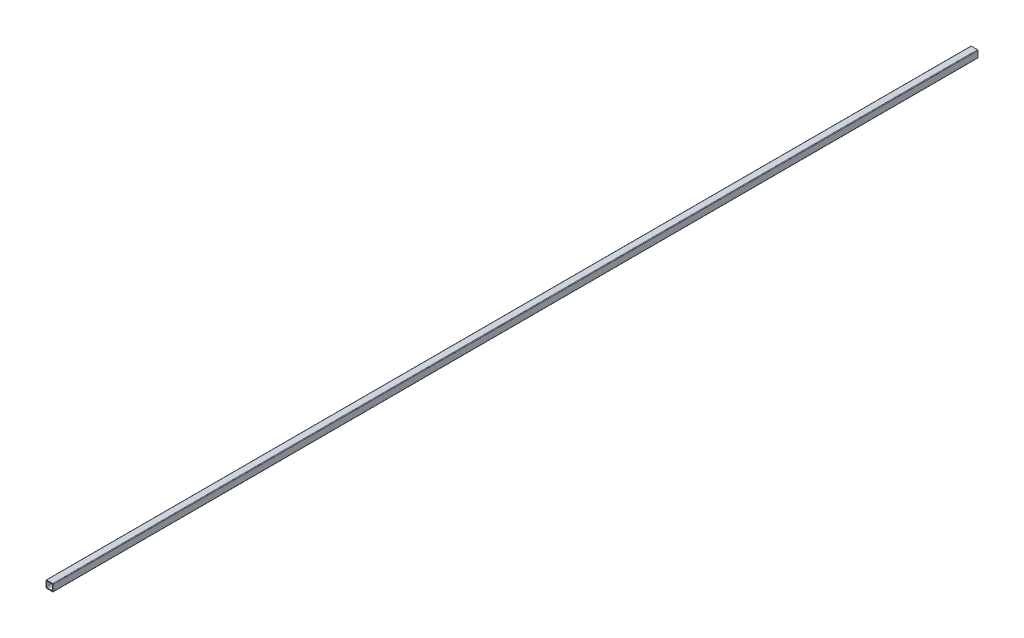
ISO-10303-21;
HEADER;
FILE_DESCRIPTION(('STEP AP214'),'2;1');
FILE_NAME('part.step','',(''),(''),'','','');
FILE_SCHEMA(('AUTOMOTIVE_DESIGN { 1 0 10303 214 1 1 1 1 }'));
ENDSEC;
DATA;
#1=APPLICATION_CONTEXT('core data for automotive mechanical design processes');
#2=APPLICATION_PROTOCOL_DEFINITION('international standard','automotive_design',2000,#1);
#3=PRODUCT_CONTEXT('',#1,'mechanical');
#4=PRODUCT('Part','Part','',(#3));
#5=PRODUCT_RELATED_PRODUCT_CATEGORY('part','',(#4));
#6=PRODUCT_DEFINITION_FORMATION('','',#4);
#7=PRODUCT_DEFINITION_CONTEXT('part definition',#1,'design');
#8=PRODUCT_DEFINITION('design','',#6,#7);
#9=PRODUCT_DEFINITION_SHAPE('','',#8);
#10=(LENGTH_UNIT() NAMED_UNIT(*) SI_UNIT(.MILLI.,.METRE.));
#11=(NAMED_UNIT(*) PLANE_ANGLE_UNIT() SI_UNIT($,.RADIAN.));
#12=(NAMED_UNIT(*) SI_UNIT($,.STERADIAN.) SOLID_ANGLE_UNIT());
#13=UNCERTAINTY_MEASURE_WITH_UNIT(LENGTH_MEASURE(1.E-05),#10,'distance_accuracy_value','');
#14=(GEOMETRIC_REPRESENTATION_CONTEXT(3) GLOBAL_UNCERTAINTY_ASSIGNED_CONTEXT((#13)) GLOBAL_UNIT_ASSIGNED_CONTEXT((#10,
#11,#12)) REPRESENTATION_CONTEXT('',''));
#15=CARTESIAN_POINT('',(0.,0.,0.));
#16=DIRECTION('',(0.,0.,1.));
#17=DIRECTION('',(1.,0.,0.));
#18=AXIS2_PLACEMENT_3D('',#15,#16,#17);
#19=CARTESIAN_POINT('',(17.526,17.526,-2438.4));
#20=DIRECTION('',(0.,0.,1.));
#21=DIRECTION('',(1.,0.,0.));
#22=AXIS2_PLACEMENT_3D('',#19,#20,#21);
#23=CYLINDRICAL_SURFACE('',#22,1.524);
#24=CARTESIAN_POINT('',(17.526,17.526,0.));
#25=DIRECTION('',(0.,0.,1.));
#26=DIRECTION('',(1.,0.,0.));
#27=AXIS2_PLACEMENT_3D('',#24,#25,#26);
#28=CIRCLE('',#27,1.524);
#29=CARTESIAN_POINT('',(19.05,17.526,0.));
#30=VERTEX_POINT('',#29);
#31=CARTESIAN_POINT('',(17.526,19.05,0.));
#32=VERTEX_POINT('',#31);
#33=EDGE_CURVE('E234',#30,#32,#28,.T.);
#34=ORIENTED_EDGE('',*,*,#33,.F.);
#35=DIRECTION('',(0.,0.,1.));
#36=VECTOR('',#35,1.);
#37=CARTESIAN_POINT('',(19.05,17.526,-2438.4));
#38=LINE('',#37,#36);
#39=CARTESIAN_POINT('',(19.05,17.526,-2438.4));
#40=VERTEX_POINT('',#39);
#41=EDGE_CURVE('E11',#40,#30,#38,.T.);
#42=ORIENTED_EDGE('',*,*,#41,.F.);
#43=CARTESIAN_POINT('',(17.526,17.526,-2438.4));
#44=DIRECTION('',(0.,0.,1.));
#45=DIRECTION('',(1.,0.,0.));
#46=AXIS2_PLACEMENT_3D('',#43,#44,#45);
#47=CIRCLE('',#46,1.524);
#48=CARTESIAN_POINT('',(17.526,19.05,-2438.4));
#49=VERTEX_POINT('',#48);
#50=EDGE_CURVE('E252',#40,#49,#47,.T.);
#51=ORIENTED_EDGE('',*,*,#50,.T.);
#52=DIRECTION('',(0.,0.,1.));
#53=VECTOR('',#52,1.);
#54=CARTESIAN_POINT('',(17.526,19.05,-2438.4));
#55=LINE('',#54,#53);
#56=EDGE_CURVE('E48',#49,#32,#55,.T.);
#57=ORIENTED_EDGE('',*,*,#56,.T.);
#58=EDGE_LOOP('',(#34,#42,#51,#57));
#59=FACE_BOUND('',#58,.T.);
#60=ADVANCED_FACE('F45',(#59),#23,.T.);
#61=CARTESIAN_POINT('',(19.05,1.52400000000001,-2438.4));
#62=DIRECTION('',(1.,0.,0.));
#63=DIRECTION('',(0.,0.,-1.));
#64=AXIS2_PLACEMENT_3D('',#61,#62,#63);
#65=PLANE('',#64);
#66=DIRECTION('',(0.,1.,0.));
#67=VECTOR('',#66,1.);
#68=CARTESIAN_POINT('',(19.05,1.52400000000001,0.));
#69=LINE('',#68,#67);
#70=CARTESIAN_POINT('',(19.05,1.52400000000001,0.));
#71=VERTEX_POINT('',#70);
#72=EDGE_CURVE('E257',#71,#30,#69,.T.);
#73=ORIENTED_EDGE('',*,*,#72,.F.);
#74=DIRECTION('',(0.,0.,1.));
#75=VECTOR('',#74,1.);
#76=CARTESIAN_POINT('',(19.05,1.52400000000001,-2438.4));
#77=LINE('',#76,#75);
#78=CARTESIAN_POINT('',(19.05,1.52400000000001,-2438.4));
#79=VERTEX_POINT('',#78);
#80=EDGE_CURVE('E54',#79,#71,#77,.T.);
#81=ORIENTED_EDGE('',*,*,#80,.F.);
#82=DIRECTION('',(0.,1.,0.));
#83=VECTOR('',#82,1.);
#84=CARTESIAN_POINT('',(19.05,1.52400000000001,-2438.4));
#85=LINE('',#84,#83);
#86=EDGE_CURVE('E281',#79,#40,#85,.T.);
#87=ORIENTED_EDGE('',*,*,#86,.T.);
#88=ORIENTED_EDGE('',*,*,#41,.T.);
#89=EDGE_LOOP('',(#73,#81,#87,#88));
#90=FACE_BOUND('',#89,.T.);
#91=ADVANCED_FACE('F344',(#90),#65,.T.);
#92=CARTESIAN_POINT('',(17.526,1.524,-2438.4));
#93=DIRECTION('',(0.,0.,1.));
#94=DIRECTION('',(1.,0.,0.));
#95=AXIS2_PLACEMENT_3D('',#92,#93,#94);
#96=CYLINDRICAL_SURFACE('',#95,1.524);
#97=CARTESIAN_POINT('',(17.526,1.524,0.));
#98=DIRECTION('',(0.,0.,1.));
#99=DIRECTION('',(-1.,0.,0.));
#100=AXIS2_PLACEMENT_3D('',#97,#98,#99);
#101=CIRCLE('',#100,1.524);
#102=CARTESIAN_POINT('',(17.526,0.,0.));
#103=VERTEX_POINT('',#102);
#104=EDGE_CURVE('E308',#103,#71,#101,.T.);
#105=ORIENTED_EDGE('',*,*,#104,.F.);
#106=DIRECTION('',(0.,0.,1.));
#107=VECTOR('',#106,1.);
#108=CARTESIAN_POINT('',(17.526,0.,-2438.4));
#109=LINE('',#108,#107);
#110=CARTESIAN_POINT('',(17.526,0.,-2438.4));
#111=VERTEX_POINT('',#110);
#112=EDGE_CURVE('E317',#111,#103,#109,.T.);
#113=ORIENTED_EDGE('',*,*,#112,.F.);
#114=CARTESIAN_POINT('',(17.526,1.524,-2438.4));
#115=DIRECTION('',(0.,0.,1.));
#116=DIRECTION('',(-1.,0.,0.));
#117=AXIS2_PLACEMENT_3D('',#114,#115,#116);
#118=CIRCLE('',#117,1.524);
#119=EDGE_CURVE('E277',#111,#79,#118,.T.);
#120=ORIENTED_EDGE('',*,*,#119,.T.);
#121=ORIENTED_EDGE('',*,*,#80,.T.);
#122=EDGE_LOOP('',(#105,#113,#120,#121));
#123=FACE_BOUND('',#122,.T.);
#124=ADVANCED_FACE('F363',(#123),#96,.T.);
#125=CARTESIAN_POINT('',(1.52400000000001,0.,-2438.4));
#126=DIRECTION('',(0.,-1.,0.));
#127=DIRECTION('',(0.,0.,-1.));
#128=AXIS2_PLACEMENT_3D('',#125,#126,#127);
#129=PLANE('',#128);
#130=DIRECTION('',(1.,0.,0.));
#131=VECTOR('',#130,1.);
#132=CARTESIAN_POINT('',(1.52400000000001,0.,0.));
#133=LINE('',#132,#131);
#134=CARTESIAN_POINT('',(1.52400000000001,0.,0.));
#135=VERTEX_POINT('',#134);
#136=EDGE_CURVE('E304',#135,#103,#133,.T.);
#137=ORIENTED_EDGE('',*,*,#136,.F.);
#138=DIRECTION('',(0.,0.,1.));
#139=VECTOR('',#138,1.);
#140=CARTESIAN_POINT('',(1.52400000000001,0.,-2438.4));
#141=LINE('',#140,#139);
#142=CARTESIAN_POINT('',(1.52400000000001,0.,-2438.4));
#143=VERTEX_POINT('',#142);
#144=EDGE_CURVE('E320',#143,#135,#141,.T.);
#145=ORIENTED_EDGE('',*,*,#144,.F.);
#146=DIRECTION('',(1.,0.,0.));
#147=VECTOR('',#146,1.);
#148=CARTESIAN_POINT('',(1.52400000000001,0.,-2438.4));
#149=LINE('',#148,#147);
#150=EDGE_CURVE('E273',#143,#111,#149,.T.);
#151=ORIENTED_EDGE('',*,*,#150,.T.);
#152=ORIENTED_EDGE('',*,*,#112,.T.);
#153=EDGE_LOOP('',(#137,#145,#151,#152));
#154=FACE_BOUND('',#153,.T.);
#155=ADVANCED_FACE('F361',(#154),#129,.T.);
#156=CARTESIAN_POINT('',(1.524,1.524,-2438.4));
#157=DIRECTION('',(0.,0.,1.));
#158=DIRECTION('',(1.,0.,0.));
#159=AXIS2_PLACEMENT_3D('',#156,#157,#158);
#160=CYLINDRICAL_SURFACE('',#159,1.524);
#161=CARTESIAN_POINT('',(1.524,1.524,0.));
#162=DIRECTION('',(0.,0.,1.));
#163=DIRECTION('',(-1.,0.,0.));
#164=AXIS2_PLACEMENT_3D('',#161,#162,#163);
#165=CIRCLE('',#164,1.524);
#166=CARTESIAN_POINT('',(0.,1.524,0.));
#167=VERTEX_POINT('',#166);
#168=EDGE_CURVE('E300',#167,#135,#165,.T.);
#169=ORIENTED_EDGE('',*,*,#168,.F.);
#170=DIRECTION('',(0.,0.,1.));
#171=VECTOR('',#170,1.);
#172=CARTESIAN_POINT('',(0.,1.524,-2438.4));
#173=LINE('',#172,#171);
#174=CARTESIAN_POINT('',(0.,1.524,-2438.4));
#175=VERTEX_POINT('',#174);
#176=EDGE_CURVE('E323',#175,#167,#173,.T.);
#177=ORIENTED_EDGE('',*,*,#176,.F.);
#178=CARTESIAN_POINT('',(1.524,1.524,-2438.4));
#179=DIRECTION('',(0.,0.,1.));
#180=DIRECTION('',(-1.,0.,0.));
#181=AXIS2_PLACEMENT_3D('',#178,#179,#180);
#182=CIRCLE('',#181,1.524);
#183=EDGE_CURVE('E269',#175,#143,#182,.T.);
#184=ORIENTED_EDGE('',*,*,#183,.T.);
#185=ORIENTED_EDGE('',*,*,#144,.T.);
#186=EDGE_LOOP('',(#169,#177,#184,#185));
#187=FACE_BOUND('',#186,.T.);
#188=ADVANCED_FACE('F357',(#187),#160,.T.);
#189=CARTESIAN_POINT('',(0.,1.52400000000001,-2438.4));
#190=DIRECTION('',(-1.,0.,0.));
#191=DIRECTION('',(0.,0.,1.));
#192=AXIS2_PLACEMENT_3D('',#189,#190,#191);
#193=PLANE('',#192);
#194=DIRECTION('',(0.,-1.,0.));
#195=VECTOR('',#194,1.);
#196=CARTESIAN_POINT('',(0.,1.52400000000001,0.));
#197=LINE('',#196,#195);
#198=CARTESIAN_POINT('',(0.,17.526,0.));
#199=VERTEX_POINT('',#198);
#200=EDGE_CURVE('E296',#199,#167,#197,.T.);
#201=ORIENTED_EDGE('',*,*,#200,.F.);
#202=DIRECTION('',(0.,0.,1.));
#203=VECTOR('',#202,1.);
#204=CARTESIAN_POINT('',(0.,17.526,-2438.4));
#205=LINE('',#204,#203);
#206=CARTESIAN_POINT('',(0.,17.526,-2438.4));
#207=VERTEX_POINT('',#206);
#208=EDGE_CURVE('E326',#207,#199,#205,.T.);
#209=ORIENTED_EDGE('',*,*,#208,.F.);
#210=DIRECTION('',(0.,-1.,0.));
#211=VECTOR('',#210,1.);
#212=CARTESIAN_POINT('',(0.,1.52400000000001,-2438.4));
#213=LINE('',#212,#211);
#214=EDGE_CURVE('E265',#207,#175,#213,.T.);
#215=ORIENTED_EDGE('',*,*,#214,.T.);
#216=ORIENTED_EDGE('',*,*,#176,.T.);
#217=EDGE_LOOP('',(#201,#209,#215,#216));
#218=FACE_BOUND('',#217,.T.);
#219=ADVANCED_FACE('F355',(#218),#193,.T.);
#220=CARTESIAN_POINT('',(1.524,17.526,-2438.4));
#221=DIRECTION('',(0.,0.,1.));
#222=DIRECTION('',(1.,0.,0.));
#223=AXIS2_PLACEMENT_3D('',#220,#221,#222);
#224=CYLINDRICAL_SURFACE('',#223,1.524);
#225=CARTESIAN_POINT('',(1.524,17.526,0.));
#226=DIRECTION('',(0.,0.,1.));
#227=DIRECTION('',(-1.,0.,0.));
#228=AXIS2_PLACEMENT_3D('',#225,#226,#227);
#229=CIRCLE('',#228,1.524);
#230=CARTESIAN_POINT('',(1.52400000000001,19.05,0.));
#231=VERTEX_POINT('',#230);
#232=EDGE_CURVE('E292',#231,#199,#229,.T.);
#233=ORIENTED_EDGE('',*,*,#232,.F.);
#234=DIRECTION('',(0.,0.,1.));
#235=VECTOR('',#234,1.);
#236=CARTESIAN_POINT('',(1.52400000000001,19.05,-2438.4));
#237=LINE('',#236,#235);
#238=CARTESIAN_POINT('',(1.52400000000001,19.05,-2438.4));
#239=VERTEX_POINT('',#238);
#240=EDGE_CURVE('E328',#239,#231,#237,.T.);
#241=ORIENTED_EDGE('',*,*,#240,.F.);
#242=CARTESIAN_POINT('',(1.524,17.526,-2438.4));
#243=DIRECTION('',(0.,0.,1.));
#244=DIRECTION('',(-1.,0.,0.));
#245=AXIS2_PLACEMENT_3D('',#242,#243,#244);
#246=CIRCLE('',#245,1.524);
#247=EDGE_CURVE('E261',#239,#207,#246,.T.);
#248=ORIENTED_EDGE('',*,*,#247,.T.);
#249=ORIENTED_EDGE('',*,*,#208,.T.);
#250=EDGE_LOOP('',(#233,#241,#248,#249));
#251=FACE_BOUND('',#250,.T.);
#252=ADVANCED_FACE('F351',(#251),#224,.T.);
#253=CARTESIAN_POINT('',(1.52400000000001,19.05,-2438.4));
#254=DIRECTION('',(0.,1.,0.));
#255=DIRECTION('',(0.,0.,1.));
#256=AXIS2_PLACEMENT_3D('',#253,#254,#255);
#257=PLANE('',#256);
#258=DIRECTION('',(-1.,0.,0.));
#259=VECTOR('',#258,1.);
#260=CARTESIAN_POINT('',(1.52400000000001,19.05,0.));
#261=LINE('',#260,#259);
#262=EDGE_CURVE('E288',#32,#231,#261,.T.);
#263=ORIENTED_EDGE('',*,*,#262,.F.);
#264=ORIENTED_EDGE('',*,*,#56,.F.);
#265=DIRECTION('',(-1.,0.,0.));
#266=VECTOR('',#265,1.);
#267=CARTESIAN_POINT('',(1.52400000000001,19.05,-2438.4));
#268=LINE('',#267,#266);
#269=EDGE_CURVE('E256',#49,#239,#268,.T.);
#270=ORIENTED_EDGE('',*,*,#269,.T.);
#271=ORIENTED_EDGE('',*,*,#240,.T.);
#272=EDGE_LOOP('',(#263,#264,#270,#271));
#273=FACE_BOUND('',#272,.T.);
#274=ADVANCED_FACE('F338',(#273),#257,.T.);
#275=CARTESIAN_POINT('',(17.526,17.526,-2438.4));
#276=DIRECTION('',(0.,0.,1.));
#277=DIRECTION('',(1.,0.,0.));
#278=AXIS2_PLACEMENT_3D('',#275,#276,#277);
#279=PLANE('',#278);
#280=DIRECTION('',(0.,1.,0.));
#281=VECTOR('',#280,1.);
#282=CARTESIAN_POINT('',(17.145,13.97,-2438.4));
#283=LINE('',#282,#281);
#284=CARTESIAN_POINT('',(17.145,5.08000000000002,-2438.4));
#285=VERTEX_POINT('',#284);
#286=CARTESIAN_POINT('',(17.145,13.97,-2438.4));
#287=VERTEX_POINT('',#286);
#288=EDGE_CURVE('E168',#285,#287,#283,.T.);
#289=ORIENTED_EDGE('',*,*,#288,.T.);
#290=CARTESIAN_POINT('',(13.97,13.97,-2438.4));
#291=DIRECTION('',(0.,0.,1.));
#292=DIRECTION('',(-1.,0.,0.));
#293=AXIS2_PLACEMENT_3D('',#290,#291,#292);
#294=CIRCLE('',#293,3.175);
#295=CARTESIAN_POINT('',(13.97,17.145,-2438.4));
#296=VERTEX_POINT('',#295);
#297=EDGE_CURVE('E161',#287,#296,#294,.T.);
#298=ORIENTED_EDGE('',*,*,#297,.T.);
#299=DIRECTION('',(-1.,0.,0.));
#300=VECTOR('',#299,1.);
#301=CARTESIAN_POINT('',(5.08000000000003,17.145,-2438.4));
#302=LINE('',#301,#300);
#303=CARTESIAN_POINT('',(5.08000000000003,17.145,-2438.4));
#304=VERTEX_POINT('',#303);
#305=EDGE_CURVE('E171',#296,#304,#302,.T.);
#306=ORIENTED_EDGE('',*,*,#305,.T.);
#307=CARTESIAN_POINT('',(5.08000000000001,13.97,-2438.4));
#308=DIRECTION('',(0.,0.,1.));
#309=DIRECTION('',(-1.,0.,0.));
#310=AXIS2_PLACEMENT_3D('',#307,#308,#309);
#311=CIRCLE('',#310,3.175);
#312=CARTESIAN_POINT('',(1.90500000000001,13.97,-2438.4));
#313=VERTEX_POINT('',#312);
#314=EDGE_CURVE('E62',#304,#313,#311,.T.);
#315=ORIENTED_EDGE('',*,*,#314,.T.);
#316=DIRECTION('',(0.,-1.,0.));
#317=VECTOR('',#316,1.);
#318=CARTESIAN_POINT('',(1.90500000000001,13.97,-2438.4));
#319=LINE('',#318,#317);
#320=CARTESIAN_POINT('',(1.90500000000001,5.08000000000002,-2438.4));
#321=VERTEX_POINT('',#320);
#322=EDGE_CURVE('E190',#313,#321,#319,.T.);
#323=ORIENTED_EDGE('',*,*,#322,.T.);
#324=CARTESIAN_POINT('',(5.08000000000001,5.08,-2438.4));
#325=DIRECTION('',(0.,0.,1.));
#326=DIRECTION('',(-1.,0.,0.));
#327=AXIS2_PLACEMENT_3D('',#324,#325,#326);
#328=CIRCLE('',#327,3.175);
#329=CARTESIAN_POINT('',(5.08000000000003,1.905,-2438.4));
#330=VERTEX_POINT('',#329);
#331=EDGE_CURVE('E194',#321,#330,#328,.T.);
#332=ORIENTED_EDGE('',*,*,#331,.T.);
#333=DIRECTION('',(1.,0.,0.));
#334=VECTOR('',#333,1.);
#335=CARTESIAN_POINT('',(5.08000000000003,1.905,-2438.4));
#336=LINE('',#335,#334);
#337=CARTESIAN_POINT('',(13.97,1.905,-2438.4));
#338=VERTEX_POINT('',#337);
#339=EDGE_CURVE('E198',#330,#338,#336,.T.);
#340=ORIENTED_EDGE('',*,*,#339,.T.);
#341=CARTESIAN_POINT('',(13.97,5.08,-2438.4));
#342=DIRECTION('',(0.,0.,1.));
#343=DIRECTION('',(-1.,0.,0.));
#344=AXIS2_PLACEMENT_3D('',#341,#342,#343);
#345=CIRCLE('',#344,3.175);
#346=EDGE_CURVE('E202',#338,#285,#345,.T.);
#347=ORIENTED_EDGE('',*,*,#346,.T.);
#348=EDGE_LOOP('',(#289,#298,#306,#315,#323,#332,#340,#347));
#349=FACE_BOUND('',#348,.T.);
#350=ORIENTED_EDGE('',*,*,#50,.F.);
#351=ORIENTED_EDGE('',*,*,#86,.F.);
#352=ORIENTED_EDGE('',*,*,#119,.F.);
#353=ORIENTED_EDGE('',*,*,#150,.F.);
#354=ORIENTED_EDGE('',*,*,#183,.F.);
#355=ORIENTED_EDGE('',*,*,#214,.F.);
#356=ORIENTED_EDGE('',*,*,#247,.F.);
#357=ORIENTED_EDGE('',*,*,#269,.F.);
#358=EDGE_LOOP('',(#350,#351,#352,#353,#354,#355,#356,#357));
#359=FACE_BOUND('',#358,.T.);
#360=ADVANCED_FACE('F176',(#349,#359),#279,.F.);
#361=CARTESIAN_POINT('',(17.526,17.526,0.));
#362=DIRECTION('',(0.,0.,1.));
#363=DIRECTION('',(1.,0.,0.));
#364=AXIS2_PLACEMENT_3D('',#361,#362,#363);
#365=PLANE('',#364);
#366=CARTESIAN_POINT('',(13.97,13.97,0.));
#367=DIRECTION('',(0.,0.,1.));
#368=DIRECTION('',(-1.,0.,0.));
#369=AXIS2_PLACEMENT_3D('',#366,#367,#368);
#370=CIRCLE('',#369,3.175);
#371=CARTESIAN_POINT('',(17.145,13.97,0.));
#372=VERTEX_POINT('',#371);
#373=CARTESIAN_POINT('',(13.97,17.145,0.));
#374=VERTEX_POINT('',#373);
#375=EDGE_CURVE('E70',#372,#374,#370,.T.);
#376=ORIENTED_EDGE('',*,*,#375,.F.);
#377=DIRECTION('',(0.,1.,0.));
#378=VECTOR('',#377,1.);
#379=CARTESIAN_POINT('',(17.145,13.97,0.));
#380=LINE('',#379,#378);
#381=CARTESIAN_POINT('',(17.145,5.08000000000002,0.));
#382=VERTEX_POINT('',#381);
#383=EDGE_CURVE('E181',#382,#372,#380,.T.);
#384=ORIENTED_EDGE('',*,*,#383,.F.);
#385=CARTESIAN_POINT('',(13.97,5.08,0.));
#386=DIRECTION('',(0.,0.,1.));
#387=DIRECTION('',(-1.,0.,0.));
#388=AXIS2_PLACEMENT_3D('',#385,#386,#387);
#389=CIRCLE('',#388,3.175);
#390=CARTESIAN_POINT('',(13.97,1.905,0.));
#391=VERTEX_POINT('',#390);
#392=EDGE_CURVE('E185',#391,#382,#389,.T.);
#393=ORIENTED_EDGE('',*,*,#392,.F.);
#394=DIRECTION('',(1.,0.,0.));
#395=VECTOR('',#394,1.);
#396=CARTESIAN_POINT('',(5.08000000000003,1.905,0.));
#397=LINE('',#396,#395);
#398=CARTESIAN_POINT('',(5.08000000000003,1.905,0.));
#399=VERTEX_POINT('',#398);
#400=EDGE_CURVE('E224',#399,#391,#397,.T.);
#401=ORIENTED_EDGE('',*,*,#400,.F.);
#402=CARTESIAN_POINT('',(5.08000000000001,5.08,0.));
#403=DIRECTION('',(0.,0.,1.));
#404=DIRECTION('',(-1.,0.,0.));
#405=AXIS2_PLACEMENT_3D('',#402,#403,#404);
#406=CIRCLE('',#405,3.175);
#407=CARTESIAN_POINT('',(1.90500000000001,5.08000000000002,0.));
#408=VERTEX_POINT('',#407);
#409=EDGE_CURVE('E220',#408,#399,#406,.T.);
#410=ORIENTED_EDGE('',*,*,#409,.F.);
#411=DIRECTION('',(0.,-1.,0.));
#412=VECTOR('',#411,1.);
#413=CARTESIAN_POINT('',(1.90500000000001,13.97,0.));
#414=LINE('',#413,#412);
#415=CARTESIAN_POINT('',(1.90500000000001,13.97,0.));
#416=VERTEX_POINT('',#415);
#417=EDGE_CURVE('E216',#416,#408,#414,.T.);
#418=ORIENTED_EDGE('',*,*,#417,.F.);
#419=CARTESIAN_POINT('',(5.08000000000001,13.97,0.));
#420=DIRECTION('',(0.,0.,1.));
#421=DIRECTION('',(-1.,0.,0.));
#422=AXIS2_PLACEMENT_3D('',#419,#420,#421);
#423=CIRCLE('',#422,3.175);
#424=CARTESIAN_POINT('',(5.08000000000003,17.145,0.));
#425=VERTEX_POINT('',#424);
#426=EDGE_CURVE('E212',#425,#416,#423,.T.);
#427=ORIENTED_EDGE('',*,*,#426,.F.);
#428=DIRECTION('',(-1.,0.,0.));
#429=VECTOR('',#428,1.);
#430=CARTESIAN_POINT('',(5.08000000000003,17.145,0.));
#431=LINE('',#430,#429);
#432=EDGE_CURVE('E209',#374,#425,#431,.T.);
#433=ORIENTED_EDGE('',*,*,#432,.F.);
#434=EDGE_LOOP('',(#376,#384,#393,#401,#410,#418,#427,#433));
#435=FACE_BOUND('',#434,.T.);
#436=ORIENTED_EDGE('',*,*,#33,.T.);
#437=ORIENTED_EDGE('',*,*,#262,.T.);
#438=ORIENTED_EDGE('',*,*,#232,.T.);
#439=ORIENTED_EDGE('',*,*,#200,.T.);
#440=ORIENTED_EDGE('',*,*,#168,.T.);
#441=ORIENTED_EDGE('',*,*,#136,.T.);
#442=ORIENTED_EDGE('',*,*,#104,.T.);
#443=ORIENTED_EDGE('',*,*,#72,.T.);
#444=EDGE_LOOP('',(#436,#437,#438,#439,#440,#441,#442,#443));
#445=FACE_BOUND('',#444,.T.);
#446=ADVANCED_FACE('F340',(#435,#445),#365,.T.);
#447=CARTESIAN_POINT('',(13.97,13.97,-2438.4));
#448=DIRECTION('',(0.,0.,1.));
#449=DIRECTION('',(1.,0.,0.));
#450=AXIS2_PLACEMENT_3D('',#447,#448,#449);
#451=CYLINDRICAL_SURFACE('',#450,3.175);
#452=ORIENTED_EDGE('',*,*,#375,.T.);
#453=DIRECTION('',(0.,0.,1.));
#454=VECTOR('',#453,1.);
#455=CARTESIAN_POINT('',(13.97,17.145,-2438.4));
#456=LINE('',#455,#454);
#457=EDGE_CURVE('E157',#296,#374,#456,.T.);
#458=ORIENTED_EDGE('',*,*,#457,.F.);
#459=ORIENTED_EDGE('',*,*,#297,.F.);
#460=DIRECTION('',(0.,0.,1.));
#461=VECTOR('',#460,1.);
#462=CARTESIAN_POINT('',(17.145,13.97,-2438.4));
#463=LINE('',#462,#461);
#464=EDGE_CURVE('E231',#287,#372,#463,.T.);
#465=ORIENTED_EDGE('',*,*,#464,.T.);
#466=EDGE_LOOP('',(#452,#458,#459,#465));
#467=FACE_BOUND('',#466,.T.);
#468=ADVANCED_FACE('F159',(#467),#451,.F.);
#469=CARTESIAN_POINT('',(17.145,13.97,-2438.4));
#470=DIRECTION('',(1.,0.,0.));
#471=DIRECTION('',(0.,1.,0.));
#472=AXIS2_PLACEMENT_3D('',#469,#470,#471);
#473=PLANE('',#472);
#474=ORIENTED_EDGE('',*,*,#383,.T.);
#475=ORIENTED_EDGE('',*,*,#464,.F.);
#476=ORIENTED_EDGE('',*,*,#288,.F.);
#477=DIRECTION('',(0.,0.,1.));
#478=VECTOR('',#477,1.);
#479=CARTESIAN_POINT('',(17.145,5.08000000000002,-2438.4));
#480=LINE('',#479,#478);
#481=EDGE_CURVE('E235',#285,#382,#480,.T.);
#482=ORIENTED_EDGE('',*,*,#481,.T.);
#483=EDGE_LOOP('',(#474,#475,#476,#482));
#484=FACE_BOUND('',#483,.T.);
#485=ADVANCED_FACE('F448',(#484),#473,.F.);
#486=CARTESIAN_POINT('',(13.97,5.08,-2438.4));
#487=DIRECTION('',(0.,0.,1.));
#488=DIRECTION('',(1.,0.,0.));
#489=AXIS2_PLACEMENT_3D('',#486,#487,#488);
#490=CYLINDRICAL_SURFACE('',#489,3.175);
#491=ORIENTED_EDGE('',*,*,#392,.T.);
#492=ORIENTED_EDGE('',*,*,#481,.F.);
#493=ORIENTED_EDGE('',*,*,#346,.F.);
#494=DIRECTION('',(0.,0.,1.));
#495=VECTOR('',#494,1.);
#496=CARTESIAN_POINT('',(13.97,1.905,-2438.4));
#497=LINE('',#496,#495);
#498=EDGE_CURVE('E238',#338,#391,#497,.T.);
#499=ORIENTED_EDGE('',*,*,#498,.T.);
#500=EDGE_LOOP('',(#491,#492,#493,#499));
#501=FACE_BOUND('',#500,.T.);
#502=ADVANCED_FACE('F457',(#501),#490,.F.);
#503=CARTESIAN_POINT('',(5.08000000000003,1.905,-2438.4));
#504=DIRECTION('',(0.,-1.,0.));
#505=DIRECTION('',(0.,0.,-1.));
#506=AXIS2_PLACEMENT_3D('',#503,#504,#505);
#507=PLANE('',#506);
#508=ORIENTED_EDGE('',*,*,#400,.T.);
#509=ORIENTED_EDGE('',*,*,#498,.F.);
#510=ORIENTED_EDGE('',*,*,#339,.F.);
#511=DIRECTION('',(0.,0.,1.));
#512=VECTOR('',#511,1.);
#513=CARTESIAN_POINT('',(5.08000000000003,1.905,-2438.4));
#514=LINE('',#513,#512);
#515=EDGE_CURVE('E241',#330,#399,#514,.T.);
#516=ORIENTED_EDGE('',*,*,#515,.T.);
#517=EDGE_LOOP('',(#508,#509,#510,#516));
#518=FACE_BOUND('',#517,.T.);
#519=ADVANCED_FACE('F467',(#518),#507,.F.);
#520=CARTESIAN_POINT('',(5.08000000000001,5.08,-2438.4));
#521=DIRECTION('',(0.,0.,1.));
#522=DIRECTION('',(1.,0.,0.));
#523=AXIS2_PLACEMENT_3D('',#520,#521,#522);
#524=CYLINDRICAL_SURFACE('',#523,3.175);
#525=ORIENTED_EDGE('',*,*,#409,.T.);
#526=ORIENTED_EDGE('',*,*,#515,.F.);
#527=ORIENTED_EDGE('',*,*,#331,.F.);
#528=DIRECTION('',(0.,0.,1.));
#529=VECTOR('',#528,1.);
#530=CARTESIAN_POINT('',(1.90500000000001,5.08000000000002,-2438.4));
#531=LINE('',#530,#529);
#532=EDGE_CURVE('E244',#321,#408,#531,.T.);
#533=ORIENTED_EDGE('',*,*,#532,.T.);
#534=EDGE_LOOP('',(#525,#526,#527,#533));
#535=FACE_BOUND('',#534,.T.);
#536=ADVANCED_FACE('F477',(#535),#524,.F.);
#537=CARTESIAN_POINT('',(1.90500000000001,13.97,-2438.4));
#538=DIRECTION('',(-1.,0.,0.));
#539=DIRECTION('',(0.,-1.,0.));
#540=AXIS2_PLACEMENT_3D('',#537,#538,#539);
#541=PLANE('',#540);
#542=ORIENTED_EDGE('',*,*,#417,.T.);
#543=ORIENTED_EDGE('',*,*,#532,.F.);
#544=ORIENTED_EDGE('',*,*,#322,.F.);
#545=DIRECTION('',(0.,0.,1.));
#546=VECTOR('',#545,1.);
#547=CARTESIAN_POINT('',(1.90500000000001,13.97,-2438.4));
#548=LINE('',#547,#546);
#549=EDGE_CURVE('E247',#313,#416,#548,.T.);
#550=ORIENTED_EDGE('',*,*,#549,.T.);
#551=EDGE_LOOP('',(#542,#543,#544,#550));
#552=FACE_BOUND('',#551,.T.);
#553=ADVANCED_FACE('F487',(#552),#541,.F.);
#554=CARTESIAN_POINT('',(5.08000000000001,13.97,-2438.4));
#555=DIRECTION('',(0.,0.,1.));
#556=DIRECTION('',(1.,0.,0.));
#557=AXIS2_PLACEMENT_3D('',#554,#555,#556);
#558=CYLINDRICAL_SURFACE('',#557,3.175);
#559=ORIENTED_EDGE('',*,*,#426,.T.);
#560=ORIENTED_EDGE('',*,*,#549,.F.);
#561=ORIENTED_EDGE('',*,*,#314,.F.);
#562=DIRECTION('',(0.,0.,1.));
#563=VECTOR('',#562,1.);
#564=CARTESIAN_POINT('',(5.08000000000003,17.145,-2438.4));
#565=LINE('',#564,#563);
#566=EDGE_CURVE('E167',#304,#425,#565,.T.);
#567=ORIENTED_EDGE('',*,*,#566,.T.);
#568=EDGE_LOOP('',(#559,#560,#561,#567));
#569=FACE_BOUND('',#568,.T.);
#570=ADVANCED_FACE('F497',(#569),#558,.F.);
#571=CARTESIAN_POINT('',(5.08000000000003,17.145,-2438.4));
#572=DIRECTION('',(0.,1.,0.));
#573=DIRECTION('',(0.,0.,1.));
#574=AXIS2_PLACEMENT_3D('',#571,#572,#573);
#575=PLANE('',#574);
#576=ORIENTED_EDGE('',*,*,#432,.T.);
#577=ORIENTED_EDGE('',*,*,#566,.F.);
#578=ORIENTED_EDGE('',*,*,#305,.F.);
#579=ORIENTED_EDGE('',*,*,#457,.T.);
#580=EDGE_LOOP('',(#576,#577,#578,#579));
#581=FACE_BOUND('',#580,.T.);
#582=ADVANCED_FACE('F172',(#581),#575,.F.);
#583=CLOSED_SHELL('',(#60,#91,#124,#155,#188,#219,#252,#274,#360,#446,#468,#485,#502,#519,#536,
#553,#570,#582));
#584=MANIFOLD_SOLID_BREP('B2',#583);
#585=ADVANCED_BREP_SHAPE_REPRESENTATION('',(#18,#584),#14);
#586=SHAPE_DEFINITION_REPRESENTATION(#9,#585);
ENDSEC;
END-ISO-10303-21;
